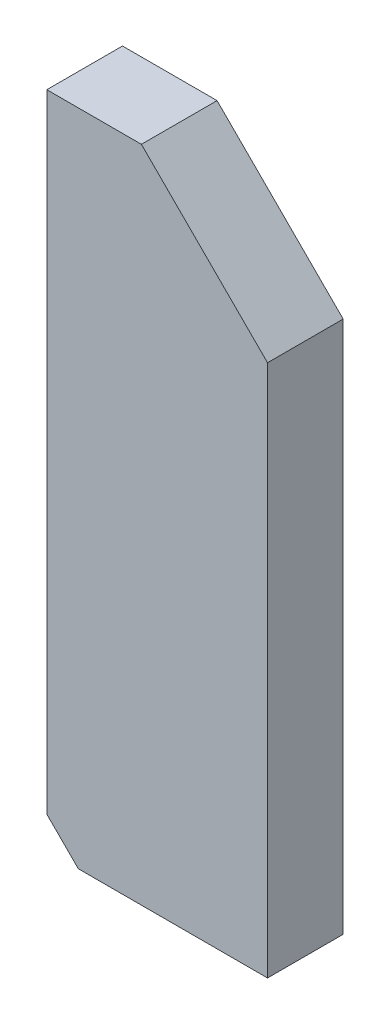
ISO-10303-21;
HEADER;
FILE_DESCRIPTION(('STEP AP214'),'2;1');
FILE_NAME('part.step','',(''),(''),'','','');
FILE_SCHEMA(('AUTOMOTIVE_DESIGN { 1 0 10303 214 1 1 1 1 }'));
ENDSEC;
DATA;
#1=APPLICATION_CONTEXT('core data for automotive mechanical design processes');
#2=APPLICATION_PROTOCOL_DEFINITION('international standard','automotive_design',2000,#1);
#3=PRODUCT_CONTEXT('',#1,'mechanical');
#4=PRODUCT('Part','Part','',(#3));
#5=PRODUCT_RELATED_PRODUCT_CATEGORY('part','',(#4));
#6=PRODUCT_DEFINITION_FORMATION('','',#4);
#7=PRODUCT_DEFINITION_CONTEXT('part definition',#1,'design');
#8=PRODUCT_DEFINITION('design','',#6,#7);
#9=PRODUCT_DEFINITION_SHAPE('','',#8);
#10=(LENGTH_UNIT() NAMED_UNIT(*) SI_UNIT(.MILLI.,.METRE.));
#11=(NAMED_UNIT(*) PLANE_ANGLE_UNIT() SI_UNIT($,.RADIAN.));
#12=(NAMED_UNIT(*) SI_UNIT($,.STERADIAN.) SOLID_ANGLE_UNIT());
#13=UNCERTAINTY_MEASURE_WITH_UNIT(LENGTH_MEASURE(1.E-05),#10,'distance_accuracy_value','');
#14=(GEOMETRIC_REPRESENTATION_CONTEXT(3) GLOBAL_UNCERTAINTY_ASSIGNED_CONTEXT((#13)) GLOBAL_UNIT_ASSIGNED_CONTEXT((#10,
#11,#12)) REPRESENTATION_CONTEXT('',''));
#15=CARTESIAN_POINT('',(0.,0.,0.));
#16=DIRECTION('',(0.,0.,1.));
#17=DIRECTION('',(1.,0.,0.));
#18=AXIS2_PLACEMENT_3D('',#15,#16,#17);
#19=CARTESIAN_POINT('',(0.,104.5,12.));
#20=DIRECTION('',(0.,-1.,0.));
#21=DIRECTION('',(0.,0.,-1.));
#22=AXIS2_PLACEMENT_3D('',#19,#20,#21);
#23=PLANE('',#22);
#24=DIRECTION('',(-1.,0.,0.));
#25=VECTOR('',#24,1.);
#26=CARTESIAN_POINT('',(0.,104.5,0.));
#27=LINE('',#26,#25);
#28=CARTESIAN_POINT('',(15.,104.5,0.));
#29=VERTEX_POINT('',#28);
#30=CARTESIAN_POINT('',(0.,104.5,0.));
#31=VERTEX_POINT('',#30);
#32=EDGE_CURVE('E132',#29,#31,#27,.T.);
#33=ORIENTED_EDGE('',*,*,#32,.T.);
#34=DIRECTION('',(0.,0.,-1.));
#35=VECTOR('',#34,1.);
#36=CARTESIAN_POINT('',(0.,104.5,12.));
#37=LINE('',#36,#35);
#38=CARTESIAN_POINT('',(0.,104.5,12.));
#39=VERTEX_POINT('',#38);
#40=EDGE_CURVE('E11',#39,#31,#37,.T.);
#41=ORIENTED_EDGE('',*,*,#40,.F.);
#42=DIRECTION('',(-1.,0.,0.));
#43=VECTOR('',#42,1.);
#44=CARTESIAN_POINT('',(0.,104.5,12.));
#45=LINE('',#44,#43);
#46=CARTESIAN_POINT('',(15.,104.5,12.));
#47=VERTEX_POINT('',#46);
#48=EDGE_CURVE('E143',#47,#39,#45,.T.);
#49=ORIENTED_EDGE('',*,*,#48,.F.);
#50=DIRECTION('',(0.,0.,-1.));
#51=VECTOR('',#50,1.);
#52=CARTESIAN_POINT('',(15.,104.5,12.));
#53=LINE('',#52,#51);
#54=EDGE_CURVE('E128',#47,#29,#53,.T.);
#55=ORIENTED_EDGE('',*,*,#54,.T.);
#56=EDGE_LOOP('',(#33,#41,#49,#55));
#57=FACE_BOUND('',#56,.T.);
#58=ADVANCED_FACE('F45',(#57),#23,.F.);
#59=CARTESIAN_POINT('',(0.,5.,12.));
#60=DIRECTION('',(1.,0.,0.));
#61=DIRECTION('',(0.,0.,-1.));
#62=AXIS2_PLACEMENT_3D('',#59,#60,#61);
#63=PLANE('',#62);
#64=CARTESIAN_POINT('',(0.,90.,6.));
#65=DIRECTION('',(-1.,0.,0.));
#66=DIRECTION('',(0.,0.,1.));
#67=AXIS2_PLACEMENT_3D('',#64,#65,#66);
#68=CIRCLE('',#67,2.09999999999999);
#69=CARTESIAN_POINT('',(0.,90.,8.09999999999999));
#70=VERTEX_POINT('',#69);
#71=EDGE_CURVE('E194',#70,#70,#68,.T.);
#72=ORIENTED_EDGE('',*,*,#71,.F.);
#73=EDGE_LOOP('',(#72));
#74=FACE_BOUND('',#73,.T.);
#75=CARTESIAN_POINT('',(0.,20.,6.));
#76=DIRECTION('',(-1.,0.,0.));
#77=DIRECTION('',(0.,0.,1.));
#78=AXIS2_PLACEMENT_3D('',#75,#76,#77);
#79=CIRCLE('',#78,2.09999999999999);
#80=CARTESIAN_POINT('',(0.,20.,8.09999999999999));
#81=VERTEX_POINT('',#80);
#82=EDGE_CURVE('E202',#81,#81,#79,.T.);
#83=ORIENTED_EDGE('',*,*,#82,.F.);
#84=EDGE_LOOP('',(#83));
#85=FACE_BOUND('',#84,.T.);
#86=DIRECTION('',(0.,-1.,0.));
#87=VECTOR('',#86,1.);
#88=CARTESIAN_POINT('',(0.,5.,0.));
#89=LINE('',#88,#87);
#90=CARTESIAN_POINT('',(0.,5.,0.));
#91=VERTEX_POINT('',#90);
#92=EDGE_CURVE('E135',#31,#91,#89,.T.);
#93=ORIENTED_EDGE('',*,*,#92,.T.);
#94=DIRECTION('',(0.,0.,-1.));
#95=VECTOR('',#94,1.);
#96=CARTESIAN_POINT('',(0.,5.,12.));
#97=LINE('',#96,#95);
#98=CARTESIAN_POINT('',(0.,5.,12.));
#99=VERTEX_POINT('',#98);
#100=EDGE_CURVE('E53',#99,#91,#97,.T.);
#101=ORIENTED_EDGE('',*,*,#100,.F.);
#102=DIRECTION('',(0.,-1.,0.));
#103=VECTOR('',#102,1.);
#104=CARTESIAN_POINT('',(0.,5.,12.));
#105=LINE('',#104,#103);
#106=EDGE_CURVE('E99',#39,#99,#105,.T.);
#107=ORIENTED_EDGE('',*,*,#106,.F.);
#108=ORIENTED_EDGE('',*,*,#40,.T.);
#109=EDGE_LOOP('',(#93,#101,#107,#108));
#110=FACE_BOUND('',#109,.T.);
#111=ADVANCED_FACE('F167',(#74,#85,#110),#63,.F.);
#112=CARTESIAN_POINT('',(0.,5.,12.));
#113=DIRECTION('',(0.707106781186547,0.707106781186548,0.));
#114=DIRECTION('',(-0.707106781186548,0.707106781186547,0.));
#115=AXIS2_PLACEMENT_3D('',#112,#113,#114);
#116=PLANE('',#115);
#117=DIRECTION('',(0.707106781186548,-0.707106781186547,0.));
#118=VECTOR('',#117,1.);
#119=CARTESIAN_POINT('',(0.,5.,0.));
#120=LINE('',#119,#118);
#121=CARTESIAN_POINT('',(5.,0.,0.));
#122=VERTEX_POINT('',#121);
#123=EDGE_CURVE('E138',#91,#122,#120,.T.);
#124=ORIENTED_EDGE('',*,*,#123,.T.);
#125=DIRECTION('',(0.,0.,-1.));
#126=VECTOR('',#125,1.);
#127=CARTESIAN_POINT('',(5.,0.,12.));
#128=LINE('',#127,#126);
#129=CARTESIAN_POINT('',(5.,0.,12.));
#130=VERTEX_POINT('',#129);
#131=EDGE_CURVE('E123',#130,#122,#128,.T.);
#132=ORIENTED_EDGE('',*,*,#131,.F.);
#133=DIRECTION('',(0.707106781186548,-0.707106781186547,0.));
#134=VECTOR('',#133,1.);
#135=CARTESIAN_POINT('',(0.,5.,12.));
#136=LINE('',#135,#134);
#137=EDGE_CURVE('E114',#99,#130,#136,.T.);
#138=ORIENTED_EDGE('',*,*,#137,.F.);
#139=ORIENTED_EDGE('',*,*,#100,.T.);
#140=EDGE_LOOP('',(#124,#132,#138,#139));
#141=FACE_BOUND('',#140,.T.);
#142=ADVANCED_FACE('F149',(#141),#116,.F.);
#143=CARTESIAN_POINT('',(5.,0.,12.));
#144=DIRECTION('',(0.,1.,0.));
#145=DIRECTION('',(0.,0.,1.));
#146=AXIS2_PLACEMENT_3D('',#143,#144,#145);
#147=PLANE('',#146);
#148=CARTESIAN_POINT('',(25.,0.,6.));
#149=DIRECTION('',(0.,-1.,0.));
#150=DIRECTION('',(0.,0.,-1.));
#151=AXIS2_PLACEMENT_3D('',#148,#149,#150);
#152=CIRCLE('',#151,2.09999999999999);
#153=CARTESIAN_POINT('',(25.,0.,3.90000000000001));
#154=VERTEX_POINT('',#153);
#155=EDGE_CURVE('E189',#154,#154,#152,.T.);
#156=ORIENTED_EDGE('',*,*,#155,.F.);
#157=EDGE_LOOP('',(#156));
#158=FACE_BOUND('',#157,.T.);
#159=DIRECTION('',(1.,0.,0.));
#160=VECTOR('',#159,1.);
#161=CARTESIAN_POINT('',(5.,0.,0.));
#162=LINE('',#161,#160);
#163=CARTESIAN_POINT('',(35.,0.,0.));
#164=VERTEX_POINT('',#163);
#165=EDGE_CURVE('E122',#122,#164,#162,.T.);
#166=ORIENTED_EDGE('',*,*,#165,.T.);
#167=DIRECTION('',(0.,0.,-1.));
#168=VECTOR('',#167,1.);
#169=CARTESIAN_POINT('',(35.,0.,12.));
#170=LINE('',#169,#168);
#171=CARTESIAN_POINT('',(35.,0.,12.));
#172=VERTEX_POINT('',#171);
#173=EDGE_CURVE('E119',#172,#164,#170,.T.);
#174=ORIENTED_EDGE('',*,*,#173,.F.);
#175=DIRECTION('',(1.,0.,0.));
#176=VECTOR('',#175,1.);
#177=CARTESIAN_POINT('',(5.,0.,12.));
#178=LINE('',#177,#176);
#179=EDGE_CURVE('E108',#130,#172,#178,.T.);
#180=ORIENTED_EDGE('',*,*,#179,.F.);
#181=ORIENTED_EDGE('',*,*,#131,.T.);
#182=EDGE_LOOP('',(#166,#174,#180,#181));
#183=FACE_BOUND('',#182,.T.);
#184=ADVANCED_FACE('F120',(#158,#183),#147,.F.);
#185=CARTESIAN_POINT('',(35.,0.,12.));
#186=DIRECTION('',(-1.,0.,0.));
#187=DIRECTION('',(0.,0.,1.));
#188=AXIS2_PLACEMENT_3D('',#185,#186,#187);
#189=PLANE('',#188);
#190=DIRECTION('',(0.,1.,0.));
#191=VECTOR('',#190,1.);
#192=CARTESIAN_POINT('',(35.,0.,0.));
#193=LINE('',#192,#191);
#194=CARTESIAN_POINT('',(35.,84.5,0.));
#195=VERTEX_POINT('',#194);
#196=EDGE_CURVE('E85',#164,#195,#193,.T.);
#197=ORIENTED_EDGE('',*,*,#196,.T.);
#198=DIRECTION('',(0.,0.,-1.));
#199=VECTOR('',#198,1.);
#200=CARTESIAN_POINT('',(35.,84.5,12.));
#201=LINE('',#200,#199);
#202=CARTESIAN_POINT('',(35.,84.5,12.));
#203=VERTEX_POINT('',#202);
#204=EDGE_CURVE('E124',#203,#195,#201,.T.);
#205=ORIENTED_EDGE('',*,*,#204,.F.);
#206=DIRECTION('',(0.,1.,0.));
#207=VECTOR('',#206,1.);
#208=CARTESIAN_POINT('',(35.,0.,12.));
#209=LINE('',#208,#207);
#210=EDGE_CURVE('E112',#172,#203,#209,.T.);
#211=ORIENTED_EDGE('',*,*,#210,.F.);
#212=ORIENTED_EDGE('',*,*,#173,.T.);
#213=EDGE_LOOP('',(#197,#205,#211,#212));
#214=FACE_BOUND('',#213,.T.);
#215=ADVANCED_FACE('F126',(#214),#189,.F.);
#216=CARTESIAN_POINT('',(15.,104.5,12.));
#217=DIRECTION('',(-0.707106781186548,-0.707106781186547,0.));
#218=DIRECTION('',(0.707106781186547,-0.707106781186548,0.));
#219=AXIS2_PLACEMENT_3D('',#216,#217,#218);
#220=PLANE('',#219);
#221=DIRECTION('',(-0.707106781186547,0.707106781186548,0.));
#222=VECTOR('',#221,1.);
#223=CARTESIAN_POINT('',(15.,104.5,0.));
#224=LINE('',#223,#222);
#225=EDGE_CURVE('E91',#195,#29,#224,.T.);
#226=ORIENTED_EDGE('',*,*,#225,.T.);
#227=ORIENTED_EDGE('',*,*,#54,.F.);
#228=DIRECTION('',(-0.707106781186547,0.707106781186548,0.));
#229=VECTOR('',#228,1.);
#230=CARTESIAN_POINT('',(15.,104.5,12.));
#231=LINE('',#230,#229);
#232=EDGE_CURVE('E61',#203,#47,#231,.T.);
#233=ORIENTED_EDGE('',*,*,#232,.F.);
#234=ORIENTED_EDGE('',*,*,#204,.T.);
#235=EDGE_LOOP('',(#226,#227,#233,#234));
#236=FACE_BOUND('',#235,.T.);
#237=ADVANCED_FACE('F156',(#236),#220,.F.);
#238=CARTESIAN_POINT('',(35.,104.5,12.));
#239=DIRECTION('',(0.,0.,1.));
#240=DIRECTION('',(1.,0.,0.));
#241=AXIS2_PLACEMENT_3D('',#238,#239,#240);
#242=PLANE('',#241);
#243=ORIENTED_EDGE('',*,*,#48,.T.);
#244=ORIENTED_EDGE('',*,*,#106,.T.);
#245=ORIENTED_EDGE('',*,*,#137,.T.);
#246=ORIENTED_EDGE('',*,*,#179,.T.);
#247=ORIENTED_EDGE('',*,*,#210,.T.);
#248=ORIENTED_EDGE('',*,*,#232,.T.);
#249=EDGE_LOOP('',(#243,#244,#245,#246,#247,#248));
#250=FACE_BOUND('',#249,.T.);
#251=ADVANCED_FACE('F110',(#250),#242,.T.);
#252=CARTESIAN_POINT('',(35.,104.5,0.));
#253=DIRECTION('',(0.,0.,1.));
#254=DIRECTION('',(1.,0.,0.));
#255=AXIS2_PLACEMENT_3D('',#252,#253,#254);
#256=PLANE('',#255);
#257=ORIENTED_EDGE('',*,*,#32,.F.);
#258=ORIENTED_EDGE('',*,*,#225,.F.);
#259=ORIENTED_EDGE('',*,*,#196,.F.);
#260=ORIENTED_EDGE('',*,*,#165,.F.);
#261=ORIENTED_EDGE('',*,*,#123,.F.);
#262=ORIENTED_EDGE('',*,*,#92,.F.);
#263=EDGE_LOOP('',(#257,#258,#259,#260,#261,#262));
#264=FACE_BOUND('',#263,.T.);
#265=ADVANCED_FACE('F152',(#264),#256,.F.);
#266=CARTESIAN_POINT('',(16.,20.,6.));
#267=DIRECTION('',(-1.,0.,0.));
#268=DIRECTION('',(0.,0.,1.));
#269=AXIS2_PLACEMENT_3D('',#266,#267,#268);
#270=CONICAL_SURFACE('',#269,2.1,1.02974425867665);
#271=CARTESIAN_POINT('',(17.2618072999579,20.,6.));
#272=VERTEX_POINT('',#271);
#273=VERTEX_LOOP('',#272);
#274=FACE_BOUND('',#273,.T.);
#275=CARTESIAN_POINT('',(16.,20.,6.));
#276=DIRECTION('',(-1.,0.,0.));
#277=DIRECTION('',(0.,0.,1.));
#278=AXIS2_PLACEMENT_3D('',#275,#276,#277);
#279=CIRCLE('',#278,2.1);
#280=CARTESIAN_POINT('',(16.,20.,8.1));
#281=VERTEX_POINT('',#280);
#282=EDGE_CURVE('E136',#281,#281,#279,.T.);
#283=ORIENTED_EDGE('',*,*,#282,.T.);
#284=EDGE_LOOP('',(#283));
#285=FACE_BOUND('',#284,.T.);
#286=ADVANCED_FACE('F210',(#274,#285),#270,.F.);
#287=CARTESIAN_POINT('',(0.,20.,6.));
#288=DIRECTION('',(-1.,0.,0.));
#289=DIRECTION('',(0.,0.,1.));
#290=AXIS2_PLACEMENT_3D('',#287,#288,#289);
#291=CYLINDRICAL_SURFACE('',#290,2.09999999999999);
#292=ORIENTED_EDGE('',*,*,#282,.F.);
#293=EDGE_LOOP('',(#292));
#294=FACE_BOUND('',#293,.T.);
#295=ORIENTED_EDGE('',*,*,#82,.T.);
#296=EDGE_LOOP('',(#295));
#297=FACE_BOUND('',#296,.T.);
#298=ADVANCED_FACE('F212',(#294,#297),#291,.F.);
#299=CARTESIAN_POINT('',(16.,90.,6.));
#300=DIRECTION('',(-1.,0.,0.));
#301=DIRECTION('',(0.,0.,1.));
#302=AXIS2_PLACEMENT_3D('',#299,#300,#301);
#303=CONICAL_SURFACE('',#302,2.09999999999999,1.02974425867665);
#304=CARTESIAN_POINT('',(17.2618072999579,90.,6.));
#305=VERTEX_POINT('',#304);
#306=VERTEX_LOOP('',#305);
#307=FACE_BOUND('',#306,.T.);
#308=CARTESIAN_POINT('',(16.,90.,6.));
#309=DIRECTION('',(-1.,0.,0.));
#310=DIRECTION('',(0.,0.,1.));
#311=AXIS2_PLACEMENT_3D('',#308,#309,#310);
#312=CIRCLE('',#311,2.09999999999999);
#313=CARTESIAN_POINT('',(16.,90.,8.09999999999999));
#314=VERTEX_POINT('',#313);
#315=EDGE_CURVE('E199',#314,#314,#312,.T.);
#316=ORIENTED_EDGE('',*,*,#315,.T.);
#317=EDGE_LOOP('',(#316));
#318=FACE_BOUND('',#317,.T.);
#319=ADVANCED_FACE('F215',(#307,#318),#303,.F.);
#320=CARTESIAN_POINT('',(0.,90.,6.));
#321=DIRECTION('',(-1.,0.,0.));
#322=DIRECTION('',(0.,0.,1.));
#323=AXIS2_PLACEMENT_3D('',#320,#321,#322);
#324=CYLINDRICAL_SURFACE('',#323,2.09999999999999);
#325=ORIENTED_EDGE('',*,*,#315,.F.);
#326=EDGE_LOOP('',(#325));
#327=FACE_BOUND('',#326,.T.);
#328=ORIENTED_EDGE('',*,*,#71,.T.);
#329=EDGE_LOOP('',(#328));
#330=FACE_BOUND('',#329,.T.);
#331=ADVANCED_FACE('F222',(#327,#330),#324,.F.);
#332=CARTESIAN_POINT('',(25.,14.,6.));
#333=DIRECTION('',(0.,-1.,0.));
#334=DIRECTION('',(0.,0.,-1.));
#335=AXIS2_PLACEMENT_3D('',#332,#333,#334);
#336=CONICAL_SURFACE('',#335,2.1,1.02974425867665);
#337=CARTESIAN_POINT('',(25.,15.2618072999579,6.));
#338=VERTEX_POINT('',#337);
#339=VERTEX_LOOP('',#338);
#340=FACE_BOUND('',#339,.T.);
#341=CARTESIAN_POINT('',(25.,14.,6.));
#342=DIRECTION('',(0.,-1.,0.));
#343=DIRECTION('',(0.,0.,-1.));
#344=AXIS2_PLACEMENT_3D('',#341,#342,#343);
#345=CIRCLE('',#344,2.1);
#346=CARTESIAN_POINT('',(25.,14.,3.9));
#347=VERTEX_POINT('',#346);
#348=EDGE_CURVE('E191',#347,#347,#345,.T.);
#349=ORIENTED_EDGE('',*,*,#348,.T.);
#350=EDGE_LOOP('',(#349));
#351=FACE_BOUND('',#350,.T.);
#352=ADVANCED_FACE('F270',(#340,#351),#336,.F.);
#353=CARTESIAN_POINT('',(25.,0.,6.));
#354=DIRECTION('',(0.,-1.,0.));
#355=DIRECTION('',(0.,0.,-1.));
#356=AXIS2_PLACEMENT_3D('',#353,#354,#355);
#357=CYLINDRICAL_SURFACE('',#356,2.09999999999999);
#358=ORIENTED_EDGE('',*,*,#348,.F.);
#359=EDGE_LOOP('',(#358));
#360=FACE_BOUND('',#359,.T.);
#361=ORIENTED_EDGE('',*,*,#155,.T.);
#362=EDGE_LOOP('',(#361));
#363=FACE_BOUND('',#362,.T.);
#364=ADVANCED_FACE('F277',(#360,#363),#357,.F.);
#365=CLOSED_SHELL('',(#58,#111,#142,#184,#215,#237,#251,#265,#286,#298,#319,#331,#352,#364));
#366=MANIFOLD_SOLID_BREP('B2',#365);
#367=ADVANCED_BREP_SHAPE_REPRESENTATION('',(#18,#366),#14);
#368=SHAPE_DEFINITION_REPRESENTATION(#9,#367);
ENDSEC;
END-ISO-10303-21;
